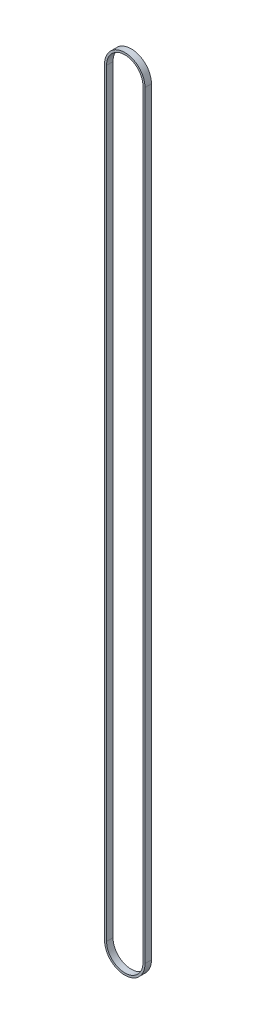
ISO-10303-21;
HEADER;
FILE_DESCRIPTION(('STEP AP214'),'2;1');
FILE_NAME('part.step','',(''),(''),'','','');
FILE_SCHEMA(('AUTOMOTIVE_DESIGN { 1 0 10303 214 1 1 1 1 }'));
ENDSEC;
DATA;
#1=APPLICATION_CONTEXT('core data for automotive mechanical design processes');
#2=APPLICATION_PROTOCOL_DEFINITION('international standard','automotive_design',2000,#1);
#3=PRODUCT_CONTEXT('',#1,'mechanical');
#4=PRODUCT('Part','Part','',(#3));
#5=PRODUCT_RELATED_PRODUCT_CATEGORY('part','',(#4));
#6=PRODUCT_DEFINITION_FORMATION('','',#4);
#7=PRODUCT_DEFINITION_CONTEXT('part definition',#1,'design');
#8=PRODUCT_DEFINITION('design','',#6,#7);
#9=PRODUCT_DEFINITION_SHAPE('','',#8);
#10=(LENGTH_UNIT() NAMED_UNIT(*) SI_UNIT(.MILLI.,.METRE.));
#11=(NAMED_UNIT(*) PLANE_ANGLE_UNIT() SI_UNIT($,.RADIAN.));
#12=(NAMED_UNIT(*) SI_UNIT($,.STERADIAN.) SOLID_ANGLE_UNIT());
#13=UNCERTAINTY_MEASURE_WITH_UNIT(LENGTH_MEASURE(1.E-05),#10,'distance_accuracy_value','');
#14=(GEOMETRIC_REPRESENTATION_CONTEXT(3) GLOBAL_UNCERTAINTY_ASSIGNED_CONTEXT((#13)) GLOBAL_UNIT_ASSIGNED_CONTEXT((#10,
#11,#12)) REPRESENTATION_CONTEXT('',''));
#15=CARTESIAN_POINT('',(0.,0.,0.));
#16=DIRECTION('',(0.,0.,1.));
#17=DIRECTION('',(1.,0.,0.));
#18=AXIS2_PLACEMENT_3D('',#15,#16,#17);
#19=CARTESIAN_POINT('',(0.,0.,3.175));
#20=DIRECTION('',(0.,0.,1.));
#21=DIRECTION('',(1.,0.,0.));
#22=AXIS2_PLACEMENT_3D('',#19,#20,#21);
#23=PLANE('',#22);
#24=CARTESIAN_POINT('',(0.,0.,3.175));
#25=DIRECTION('',(0.,0.,1.));
#26=DIRECTION('',(-1.,0.,0.));
#27=AXIS2_PLACEMENT_3D('',#24,#25,#26);
#28=CIRCLE('',#27,10.);
#29=CARTESIAN_POINT('',(-10.,0.,3.175));
#30=VERTEX_POINT('',#29);
#31=CARTESIAN_POINT('',(10.,0.,3.175));
#32=VERTEX_POINT('',#31);
#33=EDGE_CURVE('E158',#30,#32,#28,.T.);
#34=ORIENTED_EDGE('',*,*,#33,.T.);
#35=DIRECTION('',(0.,1.,0.));
#36=VECTOR('',#35,1.);
#37=CARTESIAN_POINT('',(10.,375.,3.175));
#38=LINE('',#37,#36);
#39=CARTESIAN_POINT('',(10.,375.,3.175));
#40=VERTEX_POINT('',#39);
#41=EDGE_CURVE('E161',#32,#40,#38,.T.);
#42=ORIENTED_EDGE('',*,*,#41,.T.);
#43=CARTESIAN_POINT('',(0.,375.,3.175));
#44=DIRECTION('',(0.,0.,1.));
#45=DIRECTION('',(-1.,0.,0.));
#46=AXIS2_PLACEMENT_3D('',#43,#44,#45);
#47=CIRCLE('',#46,10.);
#48=CARTESIAN_POINT('',(-10.,375.,3.175));
#49=VERTEX_POINT('',#48);
#50=EDGE_CURVE('E164',#40,#49,#47,.T.);
#51=ORIENTED_EDGE('',*,*,#50,.T.);
#52=DIRECTION('',(0.,-1.,0.));
#53=VECTOR('',#52,1.);
#54=CARTESIAN_POINT('',(-10.,0.,3.175));
#55=LINE('',#54,#53);
#56=EDGE_CURVE('E166',#49,#30,#55,.T.);
#57=ORIENTED_EDGE('',*,*,#56,.T.);
#58=EDGE_LOOP('',(#34,#42,#51,#57));
#59=FACE_BOUND('',#58,.T.);
#60=DIRECTION('',(0.,1.,0.));
#61=VECTOR('',#60,1.);
#62=CARTESIAN_POINT('',(9.,0.,3.175));
#63=LINE('',#62,#61);
#64=CARTESIAN_POINT('',(9.,0.,3.175));
#65=VERTEX_POINT('',#64);
#66=CARTESIAN_POINT('',(9.,375.,3.175));
#67=VERTEX_POINT('',#66);
#68=EDGE_CURVE('E130',#65,#67,#63,.T.);
#69=ORIENTED_EDGE('',*,*,#68,.F.);
#70=CARTESIAN_POINT('',(0.,0.,3.175));
#71=DIRECTION('',(0.,0.,-1.));
#72=DIRECTION('',(-1.,0.,0.));
#73=AXIS2_PLACEMENT_3D('',#70,#71,#72);
#74=CIRCLE('',#73,9.);
#75=CARTESIAN_POINT('',(-9.,0.,3.175));
#76=VERTEX_POINT('',#75);
#77=EDGE_CURVE('E122',#76,#65,#74,.F.);
#78=ORIENTED_EDGE('',*,*,#77,.F.);
#79=DIRECTION('',(0.,-1.,0.));
#80=VECTOR('',#79,1.);
#81=CARTESIAN_POINT('',(-9.,0.,3.175));
#82=LINE('',#81,#80);
#83=CARTESIAN_POINT('',(-9.,375.,3.175));
#84=VERTEX_POINT('',#83);
#85=EDGE_CURVE('E144',#84,#76,#82,.T.);
#86=ORIENTED_EDGE('',*,*,#85,.F.);
#87=CARTESIAN_POINT('',(0.,375.,3.175));
#88=DIRECTION('',(0.,0.,-1.));
#89=DIRECTION('',(-1.,0.,0.));
#90=AXIS2_PLACEMENT_3D('',#87,#88,#89);
#91=CIRCLE('',#90,9.);
#92=EDGE_CURVE('E142',#67,#84,#91,.F.);
#93=ORIENTED_EDGE('',*,*,#92,.F.);
#94=EDGE_LOOP('',(#69,#78,#86,#93));
#95=FACE_BOUND('',#94,.T.);
#96=ADVANCED_FACE('F57',(#59,#95),#23,.T.);
#97=CARTESIAN_POINT('',(0.,0.,0.));
#98=DIRECTION('',(0.,0.,1.));
#99=DIRECTION('',(1.,0.,0.));
#100=AXIS2_PLACEMENT_3D('',#97,#98,#99);
#101=PLANE('',#100);
#102=CARTESIAN_POINT('',(0.,0.,0.));
#103=DIRECTION('',(0.,0.,1.));
#104=DIRECTION('',(-1.,0.,0.));
#105=AXIS2_PLACEMENT_3D('',#102,#103,#104);
#106=CIRCLE('',#105,10.);
#107=CARTESIAN_POINT('',(-10.,0.,0.));
#108=VERTEX_POINT('',#107);
#109=CARTESIAN_POINT('',(10.,0.,0.));
#110=VERTEX_POINT('',#109);
#111=EDGE_CURVE('E138',#108,#110,#106,.T.);
#112=ORIENTED_EDGE('',*,*,#111,.F.);
#113=DIRECTION('',(0.,-1.,0.));
#114=VECTOR('',#113,1.);
#115=CARTESIAN_POINT('',(-10.,0.,0.));
#116=LINE('',#115,#114);
#117=CARTESIAN_POINT('',(-10.,375.,0.));
#118=VERTEX_POINT('',#117);
#119=EDGE_CURVE('E162',#118,#108,#116,.T.);
#120=ORIENTED_EDGE('',*,*,#119,.F.);
#121=CARTESIAN_POINT('',(0.,375.,0.));
#122=DIRECTION('',(0.,0.,1.));
#123=DIRECTION('',(-1.,0.,0.));
#124=AXIS2_PLACEMENT_3D('',#121,#122,#123);
#125=CIRCLE('',#124,10.);
#126=CARTESIAN_POINT('',(10.,375.,0.));
#127=VERTEX_POINT('',#126);
#128=EDGE_CURVE('E173',#127,#118,#125,.T.);
#129=ORIENTED_EDGE('',*,*,#128,.F.);
#130=DIRECTION('',(0.,1.,0.));
#131=VECTOR('',#130,1.);
#132=CARTESIAN_POINT('',(10.,375.,0.));
#133=LINE('',#132,#131);
#134=EDGE_CURVE('E171',#110,#127,#133,.T.);
#135=ORIENTED_EDGE('',*,*,#134,.F.);
#136=EDGE_LOOP('',(#112,#120,#129,#135));
#137=FACE_BOUND('',#136,.T.);
#138=CARTESIAN_POINT('',(0.,0.,0.));
#139=DIRECTION('',(0.,0.,-1.));
#140=DIRECTION('',(-1.,0.,0.));
#141=AXIS2_PLACEMENT_3D('',#138,#139,#140);
#142=CIRCLE('',#141,9.);
#143=CARTESIAN_POINT('',(-9.,0.,0.));
#144=VERTEX_POINT('',#143);
#145=CARTESIAN_POINT('',(9.,0.,0.));
#146=VERTEX_POINT('',#145);
#147=EDGE_CURVE('E80',#144,#146,#142,.F.);
#148=ORIENTED_EDGE('',*,*,#147,.T.);
#149=DIRECTION('',(0.,1.,0.));
#150=VECTOR('',#149,1.);
#151=CARTESIAN_POINT('',(9.,0.,0.));
#152=LINE('',#151,#150);
#153=CARTESIAN_POINT('',(9.,375.,0.));
#154=VERTEX_POINT('',#153);
#155=EDGE_CURVE('E137',#146,#154,#152,.T.);
#156=ORIENTED_EDGE('',*,*,#155,.T.);
#157=CARTESIAN_POINT('',(0.,375.,0.));
#158=DIRECTION('',(0.,0.,-1.));
#159=DIRECTION('',(-1.,0.,0.));
#160=AXIS2_PLACEMENT_3D('',#157,#158,#159);
#161=CIRCLE('',#160,9.);
#162=CARTESIAN_POINT('',(-9.,375.,0.));
#163=VERTEX_POINT('',#162);
#164=EDGE_CURVE('E150',#154,#163,#161,.F.);
#165=ORIENTED_EDGE('',*,*,#164,.T.);
#166=DIRECTION('',(0.,-1.,0.));
#167=VECTOR('',#166,1.);
#168=CARTESIAN_POINT('',(-9.,0.,0.));
#169=LINE('',#168,#167);
#170=EDGE_CURVE('E131',#163,#144,#169,.T.);
#171=ORIENTED_EDGE('',*,*,#170,.T.);
#172=EDGE_LOOP('',(#148,#156,#165,#171));
#173=FACE_BOUND('',#172,.T.);
#174=ADVANCED_FACE('F191',(#137,#173),#101,.F.);
#175=CARTESIAN_POINT('',(0.,0.,3.175));
#176=DIRECTION('',(0.,0.,-1.));
#177=DIRECTION('',(-1.,0.,0.));
#178=AXIS2_PLACEMENT_3D('',#175,#176,#177);
#179=CYLINDRICAL_SURFACE('',#178,10.);
#180=ORIENTED_EDGE('',*,*,#111,.T.);
#181=DIRECTION('',(0.,0.,-1.));
#182=VECTOR('',#181,1.);
#183=CARTESIAN_POINT('',(10.,0.,3.175));
#184=LINE('',#183,#182);
#185=EDGE_CURVE('E12',#32,#110,#184,.T.);
#186=ORIENTED_EDGE('',*,*,#185,.F.);
#187=ORIENTED_EDGE('',*,*,#33,.F.);
#188=DIRECTION('',(0.,0.,-1.));
#189=VECTOR('',#188,1.);
#190=CARTESIAN_POINT('',(-10.,0.,3.175));
#191=LINE('',#190,#189);
#192=EDGE_CURVE('E168',#30,#108,#191,.T.);
#193=ORIENTED_EDGE('',*,*,#192,.T.);
#194=EDGE_LOOP('',(#180,#186,#187,#193));
#195=FACE_BOUND('',#194,.T.);
#196=ADVANCED_FACE('F59',(#195),#179,.T.);
#197=CARTESIAN_POINT('',(10.,375.,3.175));
#198=DIRECTION('',(-1.,0.,0.));
#199=DIRECTION('',(0.,0.,1.));
#200=AXIS2_PLACEMENT_3D('',#197,#198,#199);
#201=PLANE('',#200);
#202=ORIENTED_EDGE('',*,*,#134,.T.);
#203=DIRECTION('',(0.,0.,-1.));
#204=VECTOR('',#203,1.);
#205=CARTESIAN_POINT('',(10.,375.,3.175));
#206=LINE('',#205,#204);
#207=EDGE_CURVE('E65',#40,#127,#206,.T.);
#208=ORIENTED_EDGE('',*,*,#207,.F.);
#209=ORIENTED_EDGE('',*,*,#41,.F.);
#210=ORIENTED_EDGE('',*,*,#185,.T.);
#211=EDGE_LOOP('',(#202,#208,#209,#210));
#212=FACE_BOUND('',#211,.T.);
#213=ADVANCED_FACE('F201',(#212),#201,.F.);
#214=CARTESIAN_POINT('',(0.,375.,3.175));
#215=DIRECTION('',(0.,0.,-1.));
#216=DIRECTION('',(-1.,0.,0.));
#217=AXIS2_PLACEMENT_3D('',#214,#215,#216);
#218=CYLINDRICAL_SURFACE('',#217,10.);
#219=ORIENTED_EDGE('',*,*,#128,.T.);
#220=DIRECTION('',(0.,0.,-1.));
#221=VECTOR('',#220,1.);
#222=CARTESIAN_POINT('',(-10.,375.,3.175));
#223=LINE('',#222,#221);
#224=EDGE_CURVE('E178',#49,#118,#223,.T.);
#225=ORIENTED_EDGE('',*,*,#224,.F.);
#226=ORIENTED_EDGE('',*,*,#50,.F.);
#227=ORIENTED_EDGE('',*,*,#207,.T.);
#228=EDGE_LOOP('',(#219,#225,#226,#227));
#229=FACE_BOUND('',#228,.T.);
#230=ADVANCED_FACE('F185',(#229),#218,.T.);
#231=CARTESIAN_POINT('',(-10.,0.,3.175));
#232=DIRECTION('',(1.,0.,0.));
#233=DIRECTION('',(0.,0.,-1.));
#234=AXIS2_PLACEMENT_3D('',#231,#232,#233);
#235=PLANE('',#234);
#236=ORIENTED_EDGE('',*,*,#119,.T.);
#237=ORIENTED_EDGE('',*,*,#192,.F.);
#238=ORIENTED_EDGE('',*,*,#56,.F.);
#239=ORIENTED_EDGE('',*,*,#224,.T.);
#240=EDGE_LOOP('',(#236,#237,#238,#239));
#241=FACE_BOUND('',#240,.T.);
#242=ADVANCED_FACE('F195',(#241),#235,.F.);
#243=CARTESIAN_POINT('',(0.,0.,3.175));
#244=DIRECTION('',(0.,0.,-1.));
#245=DIRECTION('',(-1.,0.,0.));
#246=AXIS2_PLACEMENT_3D('',#243,#244,#245);
#247=CYLINDRICAL_SURFACE('',#246,9.);
#248=ORIENTED_EDGE('',*,*,#147,.F.);
#249=DIRECTION('',(0.,0.,-1.));
#250=VECTOR('',#249,1.);
#251=CARTESIAN_POINT('',(-9.,0.,3.175));
#252=LINE('',#251,#250);
#253=EDGE_CURVE('E126',#76,#144,#252,.T.);
#254=ORIENTED_EDGE('',*,*,#253,.F.);
#255=ORIENTED_EDGE('',*,*,#77,.T.);
#256=DIRECTION('',(0.,0.,-1.));
#257=VECTOR('',#256,1.);
#258=CARTESIAN_POINT('',(9.,0.,3.175));
#259=LINE('',#258,#257);
#260=EDGE_CURVE('E125',#65,#146,#259,.T.);
#261=ORIENTED_EDGE('',*,*,#260,.T.);
#262=EDGE_LOOP('',(#248,#254,#255,#261));
#263=FACE_BOUND('',#262,.T.);
#264=ADVANCED_FACE('F124',(#263),#247,.F.);
#265=CARTESIAN_POINT('',(9.,0.,3.175));
#266=DIRECTION('',(-1.,0.,0.));
#267=DIRECTION('',(0.,0.,1.));
#268=AXIS2_PLACEMENT_3D('',#265,#266,#267);
#269=PLANE('',#268);
#270=ORIENTED_EDGE('',*,*,#155,.F.);
#271=ORIENTED_EDGE('',*,*,#260,.F.);
#272=ORIENTED_EDGE('',*,*,#68,.T.);
#273=DIRECTION('',(0.,0.,-1.));
#274=VECTOR('',#273,1.);
#275=CARTESIAN_POINT('',(9.,375.,3.175));
#276=LINE('',#275,#274);
#277=EDGE_CURVE('E139',#67,#154,#276,.T.);
#278=ORIENTED_EDGE('',*,*,#277,.T.);
#279=EDGE_LOOP('',(#270,#271,#272,#278));
#280=FACE_BOUND('',#279,.T.);
#281=ADVANCED_FACE('F134',(#280),#269,.T.);
#282=CARTESIAN_POINT('',(0.,375.,3.175));
#283=DIRECTION('',(0.,0.,-1.));
#284=DIRECTION('',(-1.,0.,0.));
#285=AXIS2_PLACEMENT_3D('',#282,#283,#284);
#286=CYLINDRICAL_SURFACE('',#285,9.);
#287=ORIENTED_EDGE('',*,*,#164,.F.);
#288=ORIENTED_EDGE('',*,*,#277,.F.);
#289=ORIENTED_EDGE('',*,*,#92,.T.);
#290=DIRECTION('',(0.,0.,-1.));
#291=VECTOR('',#290,1.);
#292=CARTESIAN_POINT('',(-9.,375.,3.175));
#293=LINE('',#292,#291);
#294=EDGE_CURVE('E72',#84,#163,#293,.T.);
#295=ORIENTED_EDGE('',*,*,#294,.T.);
#296=EDGE_LOOP('',(#287,#288,#289,#295));
#297=FACE_BOUND('',#296,.T.);
#298=ADVANCED_FACE('F224',(#297),#286,.F.);
#299=CARTESIAN_POINT('',(-9.,0.,3.175));
#300=DIRECTION('',(1.,0.,0.));
#301=DIRECTION('',(0.,0.,-1.));
#302=AXIS2_PLACEMENT_3D('',#299,#300,#301);
#303=PLANE('',#302);
#304=ORIENTED_EDGE('',*,*,#170,.F.);
#305=ORIENTED_EDGE('',*,*,#294,.F.);
#306=ORIENTED_EDGE('',*,*,#85,.T.);
#307=ORIENTED_EDGE('',*,*,#253,.T.);
#308=EDGE_LOOP('',(#304,#305,#306,#307));
#309=FACE_BOUND('',#308,.T.);
#310=ADVANCED_FACE('F228',(#309),#303,.T.);
#311=CLOSED_SHELL('',(#96,#174,#196,#213,#230,#242,#264,#281,#298,#310));
#312=MANIFOLD_SOLID_BREP('B2',#311);
#313=ADVANCED_BREP_SHAPE_REPRESENTATION('',(#18,#312),#14);
#314=SHAPE_DEFINITION_REPRESENTATION(#9,#313);
ENDSEC;
END-ISO-10303-21;
